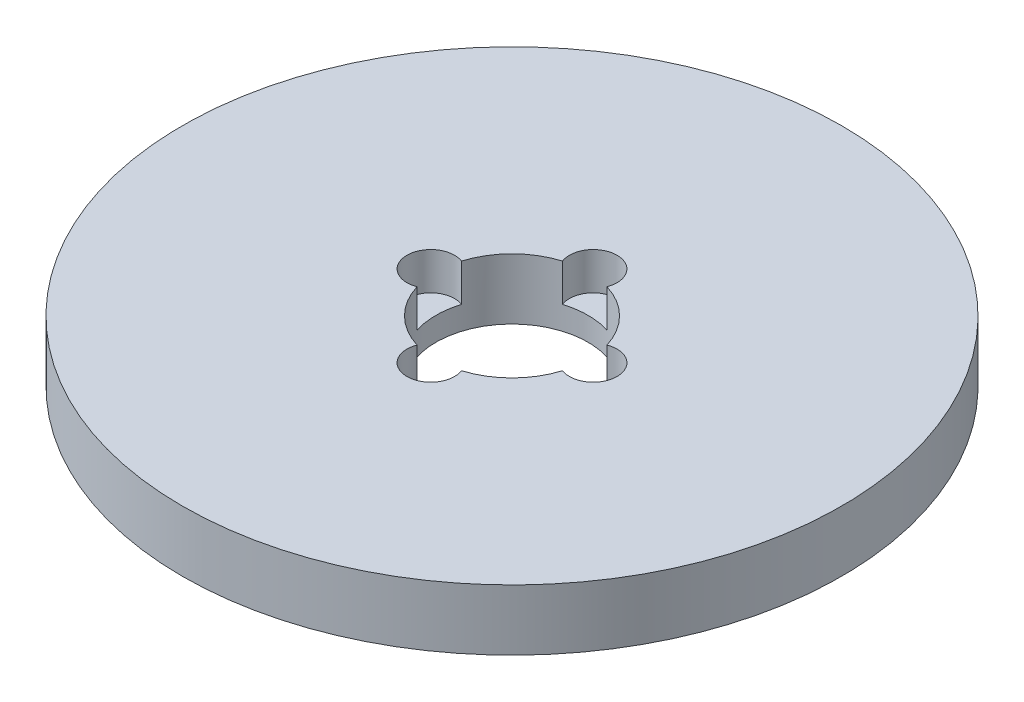
ISO-10303-21;
HEADER;
FILE_DESCRIPTION(('STEP AP214'),'2;1');
FILE_NAME('part.step','',(''),(''),'','','');
FILE_SCHEMA(('AUTOMOTIVE_DESIGN { 1 0 10303 214 1 1 1 1 }'));
ENDSEC;
DATA;
#1=APPLICATION_CONTEXT('core data for automotive mechanical design processes');
#2=APPLICATION_PROTOCOL_DEFINITION('international standard','automotive_design',2000,#1);
#3=PRODUCT_CONTEXT('',#1,'mechanical');
#4=PRODUCT('Part','Part','',(#3));
#5=PRODUCT_RELATED_PRODUCT_CATEGORY('part','',(#4));
#6=PRODUCT_DEFINITION_FORMATION('','',#4);
#7=PRODUCT_DEFINITION_CONTEXT('part definition',#1,'design');
#8=PRODUCT_DEFINITION('design','',#6,#7);
#9=PRODUCT_DEFINITION_SHAPE('','',#8);
#10=(LENGTH_UNIT() NAMED_UNIT(*) SI_UNIT(.MILLI.,.METRE.));
#11=(NAMED_UNIT(*) PLANE_ANGLE_UNIT() SI_UNIT($,.RADIAN.));
#12=(NAMED_UNIT(*) SI_UNIT($,.STERADIAN.) SOLID_ANGLE_UNIT());
#13=UNCERTAINTY_MEASURE_WITH_UNIT(LENGTH_MEASURE(1.E-05),#10,'distance_accuracy_value','');
#14=(GEOMETRIC_REPRESENTATION_CONTEXT(3) GLOBAL_UNCERTAINTY_ASSIGNED_CONTEXT((#13)) GLOBAL_UNIT_ASSIGNED_CONTEXT((#10,
#11,#12)) REPRESENTATION_CONTEXT('',''));
#15=CARTESIAN_POINT('',(0.,0.,0.));
#16=DIRECTION('',(0.,0.,1.));
#17=DIRECTION('',(1.,0.,0.));
#18=AXIS2_PLACEMENT_3D('',#15,#16,#17);
#19=CARTESIAN_POINT('',(0.,18.,0.));
#20=DIRECTION('',(0.,-1.,0.));
#21=DIRECTION('',(0.,0.,-1.));
#22=AXIS2_PLACEMENT_3D('',#19,#20,#21);
#23=CYLINDRICAL_SURFACE('',#22,97.5);
#24=CARTESIAN_POINT('',(0.,18.,0.));
#25=DIRECTION('',(0.,1.,0.));
#26=DIRECTION('',(0.,0.,1.));
#27=AXIS2_PLACEMENT_3D('',#24,#25,#26);
#28=CIRCLE('',#27,97.5);
#29=CARTESIAN_POINT('',(0.,18.,97.5));
#30=VERTEX_POINT('',#29);
#31=EDGE_CURVE('E145',#30,#30,#28,.T.);
#32=ORIENTED_EDGE('',*,*,#31,.F.);
#33=EDGE_LOOP('',(#32));
#34=FACE_BOUND('',#33,.T.);
#35=CARTESIAN_POINT('',(0.,0.,0.));
#36=DIRECTION('',(0.,1.,0.));
#37=DIRECTION('',(0.,0.,1.));
#38=AXIS2_PLACEMENT_3D('',#35,#36,#37);
#39=CIRCLE('',#38,97.5);
#40=CARTESIAN_POINT('',(0.,0.,97.5));
#41=VERTEX_POINT('',#40);
#42=EDGE_CURVE('E143',#41,#41,#39,.T.);
#43=ORIENTED_EDGE('',*,*,#42,.T.);
#44=EDGE_LOOP('',(#43));
#45=FACE_BOUND('',#44,.T.);
#46=ADVANCED_FACE('F39',(#34,#45),#23,.T.);
#47=CARTESIAN_POINT('',(0.,18.,0.));
#48=DIRECTION('',(0.,1.,0.));
#49=DIRECTION('',(0.,0.,1.));
#50=AXIS2_PLACEMENT_3D('',#47,#48,#49);
#51=PLANE('',#50);
#52=CARTESIAN_POINT('',(0.,18.,24.0397975392631));
#53=DIRECTION('',(0.,1.,0.));
#54=DIRECTION('',(1.,0.,0.));
#55=AXIS2_PLACEMENT_3D('',#52,#53,#54);
#56=CIRCLE('',#55,7.04428321809853);
#57=CARTESIAN_POINT('',(-6.57712730812451,18.,21.517234868187));
#58=VERTEX_POINT('',#57);
#59=CARTESIAN_POINT('',(6.57712730812466,18.,21.517234868187));
#60=VERTEX_POINT('',#59);
#61=EDGE_CURVE('E152',#58,#60,#56,.T.);
#62=ORIENTED_EDGE('',*,*,#61,.F.);
#63=CARTESIAN_POINT('',(0.,18.,0.));
#64=DIRECTION('',(0.,1.,0.));
#65=DIRECTION('',(0.,0.,1.));
#66=AXIS2_PLACEMENT_3D('',#63,#64,#65);
#67=CIRCLE('',#66,22.5);
#68=CARTESIAN_POINT('',(-21.517234868187,18.,6.57712730812458));
#69=VERTEX_POINT('',#68);
#70=EDGE_CURVE('E133',#69,#58,#67,.T.);
#71=ORIENTED_EDGE('',*,*,#70,.F.);
#72=CARTESIAN_POINT('',(-24.0397975392631,18.,0.));
#73=DIRECTION('',(0.,1.,0.));
#74=DIRECTION('',(0.,0.,1.));
#75=AXIS2_PLACEMENT_3D('',#72,#73,#74);
#76=CIRCLE('',#75,7.04428321809853);
#77=CARTESIAN_POINT('',(-21.517234868187,18.,-6.57712730812458));
#78=VERTEX_POINT('',#77);
#79=EDGE_CURVE('E128',#78,#69,#76,.T.);
#80=ORIENTED_EDGE('',*,*,#79,.F.);
#81=CARTESIAN_POINT('',(-6.57712730812481,18.,-21.5172348681869));
#82=VERTEX_POINT('',#81);
#83=EDGE_CURVE('E121',#82,#78,#67,.T.);
#84=ORIENTED_EDGE('',*,*,#83,.F.);
#85=CARTESIAN_POINT('',(-2.51803513493712E-13,18.,-24.0397975392631));
#86=DIRECTION('',(0.,1.,0.));
#87=DIRECTION('',(-1.,0.,0.));
#88=AXIS2_PLACEMENT_3D('',#85,#86,#87);
#89=CIRCLE('',#88,7.04428321809853);
#90=CARTESIAN_POINT('',(6.57712730812436,18.,-21.5172348681871));
#91=VERTEX_POINT('',#90);
#92=EDGE_CURVE('E105',#91,#82,#89,.T.);
#93=ORIENTED_EDGE('',*,*,#92,.F.);
#94=CARTESIAN_POINT('',(21.517234868187,18.,-6.57712730812458));
#95=VERTEX_POINT('',#94);
#96=EDGE_CURVE('E131',#95,#91,#67,.T.);
#97=ORIENTED_EDGE('',*,*,#96,.F.);
#98=CARTESIAN_POINT('',(24.0397975392631,18.,0.));
#99=DIRECTION('',(0.,1.,0.));
#100=DIRECTION('',(0.,0.,-1.));
#101=AXIS2_PLACEMENT_3D('',#98,#99,#100);
#102=CIRCLE('',#101,7.04428321809853);
#103=CARTESIAN_POINT('',(21.517234868187,18.,6.57712730812458));
#104=VERTEX_POINT('',#103);
#105=EDGE_CURVE('E154',#104,#95,#102,.T.);
#106=ORIENTED_EDGE('',*,*,#105,.F.);
#107=EDGE_CURVE('E134',#60,#104,#67,.T.);
#108=ORIENTED_EDGE('',*,*,#107,.F.);
#109=EDGE_LOOP('',(#62,#71,#80,#84,#93,#97,#106,#108));
#110=FACE_BOUND('',#109,.T.);
#111=ORIENTED_EDGE('',*,*,#31,.T.);
#112=EDGE_LOOP('',(#111));
#113=FACE_BOUND('',#112,.T.);
#114=ADVANCED_FACE('F130',(#110,#113),#51,.T.);
#115=CARTESIAN_POINT('',(0.,0.,0.));
#116=DIRECTION('',(0.,1.,0.));
#117=DIRECTION('',(0.,0.,1.));
#118=AXIS2_PLACEMENT_3D('',#115,#116,#117);
#119=PLANE('',#118);
#120=CARTESIAN_POINT('',(0.,0.,0.));
#121=DIRECTION('',(0.,1.,0.));
#122=DIRECTION('',(0.,0.,1.));
#123=AXIS2_PLACEMENT_3D('',#120,#121,#122);
#124=CIRCLE('',#123,22.5);
#125=CARTESIAN_POINT('',(0.,0.,22.5));
#126=VERTEX_POINT('',#125);
#127=EDGE_CURVE('E135',#126,#126,#124,.T.);
#128=ORIENTED_EDGE('',*,*,#127,.T.);
#129=EDGE_LOOP('',(#128));
#130=FACE_BOUND('',#129,.T.);
#131=ORIENTED_EDGE('',*,*,#42,.F.);
#132=EDGE_LOOP('',(#131));
#133=FACE_BOUND('',#132,.T.);
#134=ADVANCED_FACE('F195',(#130,#133),#119,.F.);
#135=CARTESIAN_POINT('',(0.,18.,0.));
#136=DIRECTION('',(0.,-1.,0.));
#137=DIRECTION('',(0.,0.,-1.));
#138=AXIS2_PLACEMENT_3D('',#135,#136,#137);
#139=CYLINDRICAL_SURFACE('',#138,22.5);
#140=DIRECTION('',(0.,1.,0.));
#141=VECTOR('',#140,1.);
#142=CARTESIAN_POINT('',(-6.57712730812451,12.450411453732,21.517234868187));
#143=LINE('',#142,#141);
#144=CARTESIAN_POINT('',(-6.57712730812451,6.90082290746406,21.517234868187));
#145=VERTEX_POINT('',#144);
#146=EDGE_CURVE('E11',#145,#58,#143,.T.);
#147=ORIENTED_EDGE('',*,*,#146,.F.);
#148=CARTESIAN_POINT('',(0.,6.90082290746406,0.));
#149=DIRECTION('',(0.,1.,0.));
#150=DIRECTION('',(0.,0.,1.));
#151=AXIS2_PLACEMENT_3D('',#148,#149,#150);
#152=CIRCLE('',#151,22.5);
#153=CARTESIAN_POINT('',(6.57712730812466,6.90082290746406,21.517234868187));
#154=VERTEX_POINT('',#153);
#155=EDGE_CURVE('E169',#145,#154,#152,.T.);
#156=ORIENTED_EDGE('',*,*,#155,.T.);
#157=DIRECTION('',(0.,1.,0.));
#158=VECTOR('',#157,1.);
#159=CARTESIAN_POINT('',(6.57712730812466,12.450411453732,21.517234868187));
#160=LINE('',#159,#158);
#161=EDGE_CURVE('E46',#60,#154,#160,.F.);
#162=ORIENTED_EDGE('',*,*,#161,.F.);
#163=ORIENTED_EDGE('',*,*,#107,.T.);
#164=DIRECTION('',(0.,1.,0.));
#165=VECTOR('',#164,1.);
#166=CARTESIAN_POINT('',(21.517234868187,12.450411453732,6.57712730812458));
#167=LINE('',#166,#165);
#168=CARTESIAN_POINT('',(21.517234868187,6.90082290746406,6.57712730812458));
#169=VERTEX_POINT('',#168);
#170=EDGE_CURVE('E151',#169,#104,#167,.T.);
#171=ORIENTED_EDGE('',*,*,#170,.F.);
#172=CARTESIAN_POINT('',(0.,6.90082290746406,0.));
#173=DIRECTION('',(0.,1.,0.));
#174=DIRECTION('',(0.,0.,1.));
#175=AXIS2_PLACEMENT_3D('',#172,#173,#174);
#176=CIRCLE('',#175,22.5);
#177=CARTESIAN_POINT('',(21.517234868187,6.90082290746406,-6.57712730812458));
#178=VERTEX_POINT('',#177);
#179=EDGE_CURVE('E173',#169,#178,#176,.T.);
#180=ORIENTED_EDGE('',*,*,#179,.T.);
#181=DIRECTION('',(0.,1.,0.));
#182=VECTOR('',#181,1.);
#183=CARTESIAN_POINT('',(21.517234868187,12.450411453732,-6.57712730812458));
#184=LINE('',#183,#182);
#185=EDGE_CURVE('E168',#95,#178,#184,.F.);
#186=ORIENTED_EDGE('',*,*,#185,.F.);
#187=ORIENTED_EDGE('',*,*,#96,.T.);
#188=DIRECTION('',(0.,1.,0.));
#189=VECTOR('',#188,1.);
#190=CARTESIAN_POINT('',(6.57712730812436,12.450411453732,-21.5172348681871));
#191=LINE('',#190,#189);
#192=CARTESIAN_POINT('',(6.57712730812436,6.90082290746406,-21.5172348681871));
#193=VERTEX_POINT('',#192);
#194=EDGE_CURVE('E108',#193,#91,#191,.T.);
#195=ORIENTED_EDGE('',*,*,#194,.F.);
#196=CARTESIAN_POINT('',(0.,6.90082290746406,0.));
#197=DIRECTION('',(0.,1.,0.));
#198=DIRECTION('',(0.,0.,1.));
#199=AXIS2_PLACEMENT_3D('',#196,#197,#198);
#200=CIRCLE('',#199,22.5);
#201=CARTESIAN_POINT('',(-6.57712730812481,6.90082290746406,-21.5172348681869));
#202=VERTEX_POINT('',#201);
#203=EDGE_CURVE('E122',#193,#202,#200,.T.);
#204=ORIENTED_EDGE('',*,*,#203,.T.);
#205=DIRECTION('',(0.,1.,0.));
#206=VECTOR('',#205,1.);
#207=CARTESIAN_POINT('',(-6.57712730812481,12.450411453732,-21.5172348681869));
#208=LINE('',#207,#206);
#209=EDGE_CURVE('E106',#82,#202,#208,.F.);
#210=ORIENTED_EDGE('',*,*,#209,.F.);
#211=ORIENTED_EDGE('',*,*,#83,.T.);
#212=DIRECTION('',(0.,1.,0.));
#213=VECTOR('',#212,1.);
#214=CARTESIAN_POINT('',(-21.517234868187,12.450411453732,-6.57712730812458));
#215=LINE('',#214,#213);
#216=CARTESIAN_POINT('',(-21.517234868187,6.90082290746406,-6.57712730812458));
#217=VERTEX_POINT('',#216);
#218=EDGE_CURVE('E177',#217,#78,#215,.T.);
#219=ORIENTED_EDGE('',*,*,#218,.F.);
#220=CARTESIAN_POINT('',(0.,6.90082290746406,0.));
#221=DIRECTION('',(0.,1.,0.));
#222=DIRECTION('',(0.,0.,1.));
#223=AXIS2_PLACEMENT_3D('',#220,#221,#222);
#224=CIRCLE('',#223,22.5);
#225=CARTESIAN_POINT('',(-21.517234868187,6.90082290746406,6.57712730812458));
#226=VERTEX_POINT('',#225);
#227=EDGE_CURVE('E185',#217,#226,#224,.T.);
#228=ORIENTED_EDGE('',*,*,#227,.T.);
#229=DIRECTION('',(0.,1.,0.));
#230=VECTOR('',#229,1.);
#231=CARTESIAN_POINT('',(-21.517234868187,12.450411453732,6.57712730812458));
#232=LINE('',#231,#230);
#233=EDGE_CURVE('E179',#69,#226,#232,.F.);
#234=ORIENTED_EDGE('',*,*,#233,.F.);
#235=ORIENTED_EDGE('',*,*,#70,.T.);
#236=EDGE_LOOP('',(#147,#156,#162,#163,#171,#180,#186,#187,#195,#204,#210,#211,#219,#228,#234,#235));
#237=FACE_BOUND('',#236,.T.);
#238=ORIENTED_EDGE('',*,*,#127,.F.);
#239=EDGE_LOOP('',(#238));
#240=FACE_BOUND('',#239,.T.);
#241=ADVANCED_FACE('F117',(#237,#240),#139,.F.);
#242=CARTESIAN_POINT('',(-24.0397975392631,6.90082290746406,0.));
#243=DIRECTION('',(0.,1.,0.));
#244=DIRECTION('',(0.,0.,1.));
#245=AXIS2_PLACEMENT_3D('',#242,#243,#244);
#246=CYLINDRICAL_SURFACE('',#245,7.04428321809853);
#247=ORIENTED_EDGE('',*,*,#218,.T.);
#248=ORIENTED_EDGE('',*,*,#79,.T.);
#249=ORIENTED_EDGE('',*,*,#233,.T.);
#250=CARTESIAN_POINT('',(-24.0397975392631,6.90082290746406,0.));
#251=DIRECTION('',(0.,1.,0.));
#252=DIRECTION('',(0.,0.,1.));
#253=AXIS2_PLACEMENT_3D('',#250,#251,#252);
#254=CIRCLE('',#253,7.04428321809853);
#255=EDGE_CURVE('E140',#217,#226,#254,.T.);
#256=ORIENTED_EDGE('',*,*,#255,.F.);
#257=EDGE_LOOP('',(#247,#248,#249,#256));
#258=FACE_BOUND('',#257,.T.);
#259=ADVANCED_FACE('F200',(#258),#246,.F.);
#260=CARTESIAN_POINT('',(-24.0397975392631,6.90082290746406,0.));
#261=DIRECTION('',(0.,1.,0.));
#262=DIRECTION('',(0.,0.,1.));
#263=AXIS2_PLACEMENT_3D('',#260,#261,#262);
#264=PLANE('',#263);
#265=ORIENTED_EDGE('',*,*,#255,.T.);
#266=ORIENTED_EDGE('',*,*,#227,.F.);
#267=EDGE_LOOP('',(#265,#266));
#268=FACE_BOUND('',#267,.T.);
#269=ADVANCED_FACE('F202',(#268),#264,.T.);
#270=CARTESIAN_POINT('',(-2.51803513493712E-13,6.90082290746406,-24.0397975392631));
#271=DIRECTION('',(0.,1.,0.));
#272=DIRECTION('',(0.,0.,1.));
#273=AXIS2_PLACEMENT_3D('',#270,#271,#272);
#274=CYLINDRICAL_SURFACE('',#273,7.04428321809853);
#275=ORIENTED_EDGE('',*,*,#194,.T.);
#276=ORIENTED_EDGE('',*,*,#92,.T.);
#277=ORIENTED_EDGE('',*,*,#209,.T.);
#278=CARTESIAN_POINT('',(-2.51803513493712E-13,6.90082290746406,-24.0397975392631));
#279=DIRECTION('',(0.,1.,0.));
#280=DIRECTION('',(-1.,0.,0.));
#281=AXIS2_PLACEMENT_3D('',#278,#279,#280);
#282=CIRCLE('',#281,7.04428321809853);
#283=EDGE_CURVE('E111',#193,#202,#282,.T.);
#284=ORIENTED_EDGE('',*,*,#283,.F.);
#285=EDGE_LOOP('',(#275,#276,#277,#284));
#286=FACE_BOUND('',#285,.T.);
#287=ADVANCED_FACE('F102',(#286),#274,.F.);
#288=CARTESIAN_POINT('',(-2.51803513493712E-13,6.90082290746406,-24.0397975392631));
#289=DIRECTION('',(0.,1.,0.));
#290=DIRECTION('',(-1.,0.,0.));
#291=AXIS2_PLACEMENT_3D('',#288,#289,#290);
#292=PLANE('',#291);
#293=ORIENTED_EDGE('',*,*,#283,.T.);
#294=ORIENTED_EDGE('',*,*,#203,.F.);
#295=EDGE_LOOP('',(#293,#294));
#296=FACE_BOUND('',#295,.T.);
#297=ADVANCED_FACE('F211',(#296),#292,.T.);
#298=CARTESIAN_POINT('',(24.0397975392631,6.90082290746406,0.));
#299=DIRECTION('',(0.,1.,0.));
#300=DIRECTION('',(0.,0.,1.));
#301=AXIS2_PLACEMENT_3D('',#298,#299,#300);
#302=CYLINDRICAL_SURFACE('',#301,7.04428321809853);
#303=ORIENTED_EDGE('',*,*,#170,.T.);
#304=ORIENTED_EDGE('',*,*,#105,.T.);
#305=ORIENTED_EDGE('',*,*,#185,.T.);
#306=CARTESIAN_POINT('',(24.0397975392631,6.90082290746406,0.));
#307=DIRECTION('',(0.,1.,0.));
#308=DIRECTION('',(0.,0.,-1.));
#309=AXIS2_PLACEMENT_3D('',#306,#307,#308);
#310=CIRCLE('',#309,7.04428321809853);
#311=EDGE_CURVE('E56',#169,#178,#310,.T.);
#312=ORIENTED_EDGE('',*,*,#311,.F.);
#313=EDGE_LOOP('',(#303,#304,#305,#312));
#314=FACE_BOUND('',#313,.T.);
#315=ADVANCED_FACE('F212',(#314),#302,.F.);
#316=CARTESIAN_POINT('',(24.0397975392631,6.90082290746406,0.));
#317=DIRECTION('',(0.,1.,0.));
#318=DIRECTION('',(0.,0.,-1.));
#319=AXIS2_PLACEMENT_3D('',#316,#317,#318);
#320=PLANE('',#319);
#321=ORIENTED_EDGE('',*,*,#311,.T.);
#322=ORIENTED_EDGE('',*,*,#179,.F.);
#323=EDGE_LOOP('',(#321,#322));
#324=FACE_BOUND('',#323,.T.);
#325=ADVANCED_FACE('F217',(#324),#320,.T.);
#326=CARTESIAN_POINT('',(0.,6.90082290746406,24.0397975392631));
#327=DIRECTION('',(0.,1.,0.));
#328=DIRECTION('',(0.,0.,1.));
#329=AXIS2_PLACEMENT_3D('',#326,#327,#328);
#330=CYLINDRICAL_SURFACE('',#329,7.04428321809853);
#331=ORIENTED_EDGE('',*,*,#146,.T.);
#332=ORIENTED_EDGE('',*,*,#61,.T.);
#333=ORIENTED_EDGE('',*,*,#161,.T.);
#334=CARTESIAN_POINT('',(0.,6.90082290746406,24.0397975392631));
#335=DIRECTION('',(0.,1.,0.));
#336=DIRECTION('',(1.,0.,0.));
#337=AXIS2_PLACEMENT_3D('',#334,#335,#336);
#338=CIRCLE('',#337,7.04428321809853);
#339=EDGE_CURVE('E55',#145,#154,#338,.T.);
#340=ORIENTED_EDGE('',*,*,#339,.F.);
#341=EDGE_LOOP('',(#331,#332,#333,#340));
#342=FACE_BOUND('',#341,.T.);
#343=ADVANCED_FACE('F170',(#342),#330,.F.);
#344=CARTESIAN_POINT('',(0.,6.90082290746406,24.0397975392631));
#345=DIRECTION('',(0.,1.,0.));
#346=DIRECTION('',(1.,0.,0.));
#347=AXIS2_PLACEMENT_3D('',#344,#345,#346);
#348=PLANE('',#347);
#349=ORIENTED_EDGE('',*,*,#339,.T.);
#350=ORIENTED_EDGE('',*,*,#155,.F.);
#351=EDGE_LOOP('',(#349,#350));
#352=FACE_BOUND('',#351,.T.);
#353=ADVANCED_FACE('F224',(#352),#348,.T.);
#354=CLOSED_SHELL('',(#46,#114,#134,#241,#259,#269,#287,#297,#315,#325,#343,#353));
#355=MANIFOLD_SOLID_BREP('B2',#354);
#356=ADVANCED_BREP_SHAPE_REPRESENTATION('',(#18,#355),#14);
#357=SHAPE_DEFINITION_REPRESENTATION(#9,#356);
ENDSEC;
END-ISO-10303-21;
